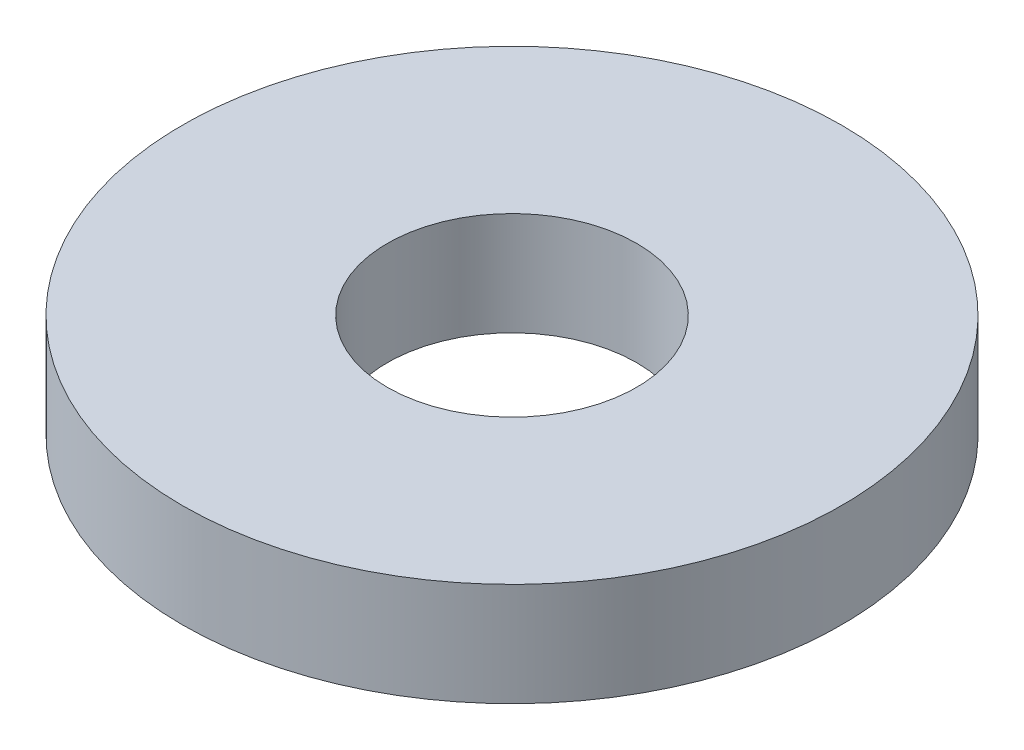
ISO-10303-21;
HEADER;
FILE_DESCRIPTION(('STEP AP214'),'2;1');
FILE_NAME('part.step','',(''),(''),'','','');
FILE_SCHEMA(('AUTOMOTIVE_DESIGN { 1 0 10303 214 1 1 1 1 }'));
ENDSEC;
DATA;
#1=APPLICATION_CONTEXT('core data for automotive mechanical design processes');
#2=APPLICATION_PROTOCOL_DEFINITION('international standard','automotive_design',2000,#1);
#3=PRODUCT_CONTEXT('',#1,'mechanical');
#4=PRODUCT('Part','Part','',(#3));
#5=PRODUCT_RELATED_PRODUCT_CATEGORY('part','',(#4));
#6=PRODUCT_DEFINITION_FORMATION('','',#4);
#7=PRODUCT_DEFINITION_CONTEXT('part definition',#1,'design');
#8=PRODUCT_DEFINITION('design','',#6,#7);
#9=PRODUCT_DEFINITION_SHAPE('','',#8);
#10=(LENGTH_UNIT() NAMED_UNIT(*) SI_UNIT(.MILLI.,.METRE.));
#11=(NAMED_UNIT(*) PLANE_ANGLE_UNIT() SI_UNIT($,.RADIAN.));
#12=(NAMED_UNIT(*) SI_UNIT($,.STERADIAN.) SOLID_ANGLE_UNIT());
#13=UNCERTAINTY_MEASURE_WITH_UNIT(LENGTH_MEASURE(1.E-05),#10,'distance_accuracy_value','');
#14=(GEOMETRIC_REPRESENTATION_CONTEXT(3) GLOBAL_UNCERTAINTY_ASSIGNED_CONTEXT((#13)) GLOBAL_UNIT_ASSIGNED_CONTEXT((#10,
#11,#12)) REPRESENTATION_CONTEXT('',''));
#15=CARTESIAN_POINT('',(0.,0.,0.));
#16=DIRECTION('',(0.,0.,1.));
#17=DIRECTION('',(1.,0.,0.));
#18=AXIS2_PLACEMENT_3D('',#15,#16,#17);
#19=CARTESIAN_POINT('',(0.,29.,0.));
#20=DIRECTION('',(0.,-1.,0.));
#21=DIRECTION('',(0.,0.,-1.));
#22=AXIS2_PLACEMENT_3D('',#19,#20,#21);
#23=CYLINDRICAL_SURFACE('',#22,92.5);
#24=CARTESIAN_POINT('',(0.,29.,0.));
#25=DIRECTION('',(0.,1.,0.));
#26=DIRECTION('',(0.,0.,1.));
#27=AXIS2_PLACEMENT_3D('',#24,#25,#26);
#28=CIRCLE('',#27,92.5);
#29=CARTESIAN_POINT('',(0.,29.,-92.5));
#30=VERTEX_POINT('',#29);
#31=EDGE_CURVE('E10',#30,#30,#28,.T.);
#32=CARTESIAN_POINT('',(0.,0.,0.));
#33=DIRECTION('',(0.,1.,0.));
#34=DIRECTION('',(0.,0.,1.));
#35=AXIS2_PLACEMENT_3D('',#32,#33,#34);
#36=CIRCLE('',#35,92.5);
#37=CARTESIAN_POINT('',(0.,0.,-92.5));
#38=VERTEX_POINT('',#37);
#39=EDGE_CURVE('E37',#38,#38,#36,.T.);
#40=CARTESIAN_POINT('',(0.,29.,-92.5));
#41=CARTESIAN_POINT('',(0.,28.6979166666667,-92.5));
#42=CARTESIAN_POINT('',(0.,28.3958333333333,-92.5));
#43=CARTESIAN_POINT('',(0.,27.7916666666667,-92.5));
#44=CARTESIAN_POINT('',(0.,27.4895833333333,-92.5));
#45=CARTESIAN_POINT('',(0.,26.8854166666667,-92.5));
#46=CARTESIAN_POINT('',(0.,26.5833333333333,-92.5));
#47=CARTESIAN_POINT('',(0.,25.9791666666667,-92.5));
#48=CARTESIAN_POINT('',(0.,25.6770833333333,-92.5));
#49=CARTESIAN_POINT('',(0.,25.0729166666667,-92.5));
#50=CARTESIAN_POINT('',(0.,24.7708333333333,-92.5));
#51=CARTESIAN_POINT('',(0.,24.1666666666667,-92.5));
#52=CARTESIAN_POINT('',(0.,23.8645833333333,-92.5));
#53=CARTESIAN_POINT('',(0.,23.2604166666667,-92.5));
#54=CARTESIAN_POINT('',(0.,22.9583333333333,-92.5));
#55=CARTESIAN_POINT('',(0.,22.3541666666667,-92.5));
#56=CARTESIAN_POINT('',(0.,22.0520833333333,-92.5));
#57=CARTESIAN_POINT('',(0.,21.4479166666667,-92.5));
#58=CARTESIAN_POINT('',(0.,21.1458333333333,-92.5));
#59=CARTESIAN_POINT('',(0.,20.5416666666667,-92.5));
#60=CARTESIAN_POINT('',(0.,20.2395833333333,-92.5));
#61=CARTESIAN_POINT('',(0.,19.6354166666667,-92.5));
#62=CARTESIAN_POINT('',(0.,19.3333333333333,-92.5));
#63=CARTESIAN_POINT('',(0.,18.7291666666667,-92.5));
#64=CARTESIAN_POINT('',(0.,18.4270833333333,-92.5));
#65=CARTESIAN_POINT('',(0.,17.8229166666667,-92.5));
#66=CARTESIAN_POINT('',(0.,17.5208333333333,-92.5));
#67=CARTESIAN_POINT('',(0.,16.9166666666667,-92.5));
#68=CARTESIAN_POINT('',(0.,16.6145833333333,-92.5));
#69=CARTESIAN_POINT('',(0.,16.0104166666667,-92.5));
#70=CARTESIAN_POINT('',(0.,15.7083333333333,-92.5));
#71=CARTESIAN_POINT('',(0.,15.1041666666667,-92.5));
#72=CARTESIAN_POINT('',(0.,14.8020833333333,-92.5));
#73=CARTESIAN_POINT('',(0.,14.1979166666667,-92.5));
#74=CARTESIAN_POINT('',(0.,13.8958333333333,-92.5));
#75=CARTESIAN_POINT('',(0.,13.2916666666667,-92.5));
#76=CARTESIAN_POINT('',(0.,12.9895833333333,-92.5));
#77=CARTESIAN_POINT('',(0.,12.3854166666667,-92.5));
#78=CARTESIAN_POINT('',(0.,12.0833333333333,-92.5));
#79=CARTESIAN_POINT('',(0.,11.4791666666667,-92.5));
#80=CARTESIAN_POINT('',(0.,11.1770833333333,-92.5));
#81=CARTESIAN_POINT('',(0.,10.5729166666667,-92.5));
#82=CARTESIAN_POINT('',(0.,10.2708333333333,-92.5));
#83=CARTESIAN_POINT('',(0.,9.66666666666667,-92.5));
#84=CARTESIAN_POINT('',(0.,9.36458333333333,-92.5));
#85=CARTESIAN_POINT('',(0.,8.76041666666667,-92.5));
#86=CARTESIAN_POINT('',(0.,8.45833333333333,-92.5));
#87=CARTESIAN_POINT('',(0.,7.85416666666667,-92.5));
#88=CARTESIAN_POINT('',(0.,7.55208333333333,-92.5));
#89=CARTESIAN_POINT('',(0.,6.94791666666667,-92.5));
#90=CARTESIAN_POINT('',(0.,6.64583333333333,-92.5));
#91=CARTESIAN_POINT('',(0.,6.04166666666667,-92.5));
#92=CARTESIAN_POINT('',(0.,5.73958333333333,-92.5));
#93=CARTESIAN_POINT('',(0.,5.13541666666667,-92.5));
#94=CARTESIAN_POINT('',(0.,4.83333333333333,-92.5));
#95=CARTESIAN_POINT('',(0.,4.22916666666667,-92.5));
#96=CARTESIAN_POINT('',(0.,3.92708333333333,-92.5));
#97=CARTESIAN_POINT('',(0.,3.32291666666667,-92.5));
#98=CARTESIAN_POINT('',(0.,3.02083333333333,-92.5));
#99=CARTESIAN_POINT('',(0.,2.41666666666667,-92.5));
#100=CARTESIAN_POINT('',(0.,2.11458333333333,-92.5));
#101=CARTESIAN_POINT('',(0.,1.51041666666667,-92.5));
#102=CARTESIAN_POINT('',(0.,1.20833333333333,-92.5));
#103=CARTESIAN_POINT('',(0.,0.604166666666667,-92.5));
#104=CARTESIAN_POINT('',(0.,0.302083333333333,-92.5));
#105=CARTESIAN_POINT('',(0.,0.,-92.5));
#106=B_SPLINE_CURVE_WITH_KNOTS('',3,(#40,#41,#42,#43,#44,#45,#46,#47,#48,#49,#50,#51,#52,#53,
#54,#55,#56,#57,#58,#59,#60,#61,#62,#63,#64,#65,#66,#67,#68,#69,#70,#71,#72,#73,#74,#75,#76,#77,
#78,#79,#80,#81,#82,#83,#84,#85,#86,#87,#88,#89,#90,#91,#92,#93,#94,#95,#96,#97,#98,#99,#100,
#101,#102,#103,#104,#105),.UNSPECIFIED.,.F.,.F.,(4,2,2,2,2,2,2,2,2,2,2,2,2,2,2,2,2,2,2,2,2,2,2,
2,2,2,2,2,2,2,2,2,4),(0.,0.906249999999997,1.8125,2.71875,3.625,4.53125,5.4375,6.34375,7.25,
8.15625,9.0625,9.96875,10.875,11.78125,12.6875,13.59375,14.5,15.40625,16.3125,17.21875,18.125,
19.03125,19.9375,20.84375,21.75,22.65625,23.5625,24.46875,25.375,26.28125,27.1875,28.09375,29.),.UNSPECIFIED.);
#107=EDGE_CURVE('BSEAM40',#30,#38,#106,.T.);
#108=ORIENTED_EDGE('',*,*,#31,.F.);
#109=ORIENTED_EDGE('',*,*,#39,.T.);
#110=ORIENTED_EDGE('',*,*,#107,.T.);
#111=ORIENTED_EDGE('',*,*,#107,.F.);
#112=EDGE_LOOP('',(#108,#110,#109,#111));
#113=FACE_BOUND('',#112,.T.);
#114=ADVANCED_FACE('F40',(#113),#23,.T.);
#115=CARTESIAN_POINT('',(0.,29.,0.));
#116=DIRECTION('',(0.,1.,0.));
#117=DIRECTION('',(0.,0.,1.));
#118=AXIS2_PLACEMENT_3D('',#115,#116,#117);
#119=PLANE('',#118);
#120=CARTESIAN_POINT('',(0.,29.,0.));
#121=DIRECTION('',(0.,1.,0.));
#122=DIRECTION('',(0.,0.,1.));
#123=AXIS2_PLACEMENT_3D('',#120,#121,#122);
#124=CIRCLE('',#123,35.);
#125=CARTESIAN_POINT('',(0.,29.,-35.));
#126=VERTEX_POINT('',#125);
#127=EDGE_CURVE('E50',#126,#126,#124,.T.);
#128=ORIENTED_EDGE('',*,*,#127,.F.);
#129=EDGE_LOOP('',(#128));
#130=FACE_BOUND('',#129,.T.);
#131=ORIENTED_EDGE('',*,*,#31,.T.);
#132=EDGE_LOOP('',(#131));
#133=FACE_BOUND('',#132,.T.);
#134=ADVANCED_FACE('F59',(#130,#133),#119,.T.);
#135=CARTESIAN_POINT('',(0.,0.,0.));
#136=DIRECTION('',(0.,1.,0.));
#137=DIRECTION('',(0.,0.,1.));
#138=AXIS2_PLACEMENT_3D('',#135,#136,#137);
#139=PLANE('',#138);
#140=CARTESIAN_POINT('',(0.,0.,0.));
#141=DIRECTION('',(0.,1.,0.));
#142=DIRECTION('',(0.,0.,1.));
#143=AXIS2_PLACEMENT_3D('',#140,#141,#142);
#144=CIRCLE('',#143,35.);
#145=CARTESIAN_POINT('',(0.,0.,-35.));
#146=VERTEX_POINT('',#145);
#147=EDGE_CURVE('E47',#146,#146,#144,.T.);
#148=ORIENTED_EDGE('',*,*,#147,.T.);
#149=EDGE_LOOP('',(#148));
#150=FACE_BOUND('',#149,.T.);
#151=ORIENTED_EDGE('',*,*,#39,.F.);
#152=EDGE_LOOP('',(#151));
#153=FACE_BOUND('',#152,.T.);
#154=ADVANCED_FACE('F58',(#150,#153),#139,.F.);
#155=CARTESIAN_POINT('',(0.,29.,0.));
#156=DIRECTION('',(0.,-1.,0.));
#157=DIRECTION('',(0.,0.,-1.));
#158=AXIS2_PLACEMENT_3D('',#155,#156,#157);
#159=CYLINDRICAL_SURFACE('',#158,35.);
#160=CARTESIAN_POINT('',(0.,29.,-35.));
#161=CARTESIAN_POINT('',(0.,28.6979166666667,-35.));
#162=CARTESIAN_POINT('',(0.,28.3958333333333,-35.));
#163=CARTESIAN_POINT('',(0.,27.7916666666667,-35.));
#164=CARTESIAN_POINT('',(0.,27.4895833333333,-35.));
#165=CARTESIAN_POINT('',(0.,26.8854166666667,-35.));
#166=CARTESIAN_POINT('',(0.,26.5833333333333,-35.));
#167=CARTESIAN_POINT('',(0.,25.9791666666667,-35.));
#168=CARTESIAN_POINT('',(0.,25.6770833333333,-35.));
#169=CARTESIAN_POINT('',(0.,25.0729166666667,-35.));
#170=CARTESIAN_POINT('',(0.,24.7708333333333,-35.));
#171=CARTESIAN_POINT('',(0.,24.1666666666667,-35.));
#172=CARTESIAN_POINT('',(0.,23.8645833333333,-35.));
#173=CARTESIAN_POINT('',(0.,23.2604166666667,-35.));
#174=CARTESIAN_POINT('',(0.,22.9583333333333,-35.));
#175=CARTESIAN_POINT('',(0.,22.3541666666667,-35.));
#176=CARTESIAN_POINT('',(0.,22.0520833333333,-35.));
#177=CARTESIAN_POINT('',(0.,21.4479166666667,-35.));
#178=CARTESIAN_POINT('',(0.,21.1458333333333,-35.));
#179=CARTESIAN_POINT('',(0.,20.5416666666667,-35.));
#180=CARTESIAN_POINT('',(0.,20.2395833333333,-35.));
#181=CARTESIAN_POINT('',(0.,19.6354166666667,-35.));
#182=CARTESIAN_POINT('',(0.,19.3333333333333,-35.));
#183=CARTESIAN_POINT('',(0.,18.7291666666667,-35.));
#184=CARTESIAN_POINT('',(0.,18.4270833333333,-35.));
#185=CARTESIAN_POINT('',(0.,17.8229166666667,-35.));
#186=CARTESIAN_POINT('',(0.,17.5208333333333,-35.));
#187=CARTESIAN_POINT('',(0.,16.9166666666667,-35.));
#188=CARTESIAN_POINT('',(0.,16.6145833333333,-35.));
#189=CARTESIAN_POINT('',(0.,16.0104166666667,-35.));
#190=CARTESIAN_POINT('',(0.,15.7083333333333,-35.));
#191=CARTESIAN_POINT('',(0.,15.1041666666667,-35.));
#192=CARTESIAN_POINT('',(0.,14.8020833333333,-35.));
#193=CARTESIAN_POINT('',(0.,14.1979166666667,-35.));
#194=CARTESIAN_POINT('',(0.,13.8958333333333,-35.));
#195=CARTESIAN_POINT('',(0.,13.2916666666667,-35.));
#196=CARTESIAN_POINT('',(0.,12.9895833333333,-35.));
#197=CARTESIAN_POINT('',(0.,12.3854166666667,-35.));
#198=CARTESIAN_POINT('',(0.,12.0833333333333,-35.));
#199=CARTESIAN_POINT('',(0.,11.4791666666667,-35.));
#200=CARTESIAN_POINT('',(0.,11.1770833333333,-35.));
#201=CARTESIAN_POINT('',(0.,10.5729166666667,-35.));
#202=CARTESIAN_POINT('',(0.,10.2708333333333,-35.));
#203=CARTESIAN_POINT('',(0.,9.66666666666667,-35.));
#204=CARTESIAN_POINT('',(0.,9.36458333333333,-35.));
#205=CARTESIAN_POINT('',(0.,8.76041666666667,-35.));
#206=CARTESIAN_POINT('',(0.,8.45833333333333,-35.));
#207=CARTESIAN_POINT('',(0.,7.85416666666667,-35.));
#208=CARTESIAN_POINT('',(0.,7.55208333333333,-35.));
#209=CARTESIAN_POINT('',(0.,6.94791666666667,-35.));
#210=CARTESIAN_POINT('',(0.,6.64583333333333,-35.));
#211=CARTESIAN_POINT('',(0.,6.04166666666667,-35.));
#212=CARTESIAN_POINT('',(0.,5.73958333333333,-35.));
#213=CARTESIAN_POINT('',(0.,5.13541666666667,-35.));
#214=CARTESIAN_POINT('',(0.,4.83333333333333,-35.));
#215=CARTESIAN_POINT('',(0.,4.22916666666667,-35.));
#216=CARTESIAN_POINT('',(0.,3.92708333333333,-35.));
#217=CARTESIAN_POINT('',(0.,3.32291666666667,-35.));
#218=CARTESIAN_POINT('',(0.,3.02083333333333,-35.));
#219=CARTESIAN_POINT('',(0.,2.41666666666667,-35.));
#220=CARTESIAN_POINT('',(0.,2.11458333333333,-35.));
#221=CARTESIAN_POINT('',(0.,1.51041666666667,-35.));
#222=CARTESIAN_POINT('',(0.,1.20833333333333,-35.));
#223=CARTESIAN_POINT('',(0.,0.604166666666667,-35.));
#224=CARTESIAN_POINT('',(0.,0.302083333333333,-35.));
#225=CARTESIAN_POINT('',(0.,0.,-35.));
#226=B_SPLINE_CURVE_WITH_KNOTS('',3,(#160,#161,#162,#163,#164,#165,#166,#167,#168,#169,#170,
#171,#172,#173,#174,#175,#176,#177,#178,#179,#180,#181,#182,#183,#184,#185,#186,#187,#188,#189,
#190,#191,#192,#193,#194,#195,#196,#197,#198,#199,#200,#201,#202,#203,#204,#205,#206,#207,#208,
#209,#210,#211,#212,#213,#214,#215,#216,#217,#218,#219,#220,#221,#222,#223,#224,#225),
.UNSPECIFIED.,.F.,.F.,(4,2,2,2,2,2,2,2,2,2,2,2,2,2,2,2,2,2,2,2,2,2,2,2,2,2,2,2,2,2,2,2,4),(0.,
0.906250000000001,1.8125,2.71875,3.625,4.53125,5.4375,6.34375,7.25,8.15625,9.0625,9.96875,
10.875,11.78125,12.6875,13.59375,14.5,15.40625,16.3125,17.21875,18.125,19.03125,19.9375,
20.84375,21.75,22.65625,23.5625,24.46875,25.375,26.28125,27.1875,28.09375,29.),.UNSPECIFIED.);
#227=EDGE_CURVE('BSEAM54',#126,#146,#226,.T.);
#228=ORIENTED_EDGE('',*,*,#127,.T.);
#229=ORIENTED_EDGE('',*,*,#147,.F.);
#230=ORIENTED_EDGE('',*,*,#227,.T.);
#231=ORIENTED_EDGE('',*,*,#227,.F.);
#232=EDGE_LOOP('',(#228,#230,#229,#231));
#233=FACE_BOUND('',#232,.T.);
#234=ADVANCED_FACE('F54',(#233),#159,.F.);
#235=CLOSED_SHELL('',(#114,#134,#154,#234));
#236=MANIFOLD_SOLID_BREP('B2',#235);
#237=ADVANCED_BREP_SHAPE_REPRESENTATION('',(#18,#236),#14);
#238=SHAPE_DEFINITION_REPRESENTATION(#9,#237);
ENDSEC;
END-ISO-10303-21;
